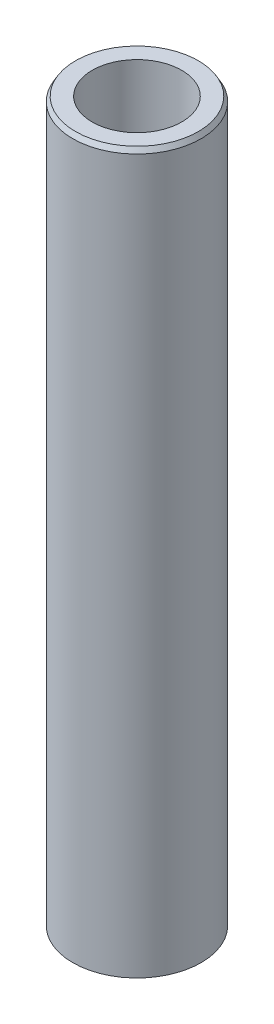
ISO-10303-21;
HEADER;
FILE_DESCRIPTION(('STEP AP214'),'2;1');
FILE_NAME('part.step','',(''),(''),'','','');
FILE_SCHEMA(('AUTOMOTIVE_DESIGN { 1 0 10303 214 1 1 1 1 }'));
ENDSEC;
DATA;
#1=APPLICATION_CONTEXT('core data for automotive mechanical design processes');
#2=APPLICATION_PROTOCOL_DEFINITION('international standard','automotive_design',2000,#1);
#3=PRODUCT_CONTEXT('',#1,'mechanical');
#4=PRODUCT('Part','Part','',(#3));
#5=PRODUCT_RELATED_PRODUCT_CATEGORY('part','',(#4));
#6=PRODUCT_DEFINITION_FORMATION('','',#4);
#7=PRODUCT_DEFINITION_CONTEXT('part definition',#1,'design');
#8=PRODUCT_DEFINITION('design','',#6,#7);
#9=PRODUCT_DEFINITION_SHAPE('','',#8);
#10=(LENGTH_UNIT() NAMED_UNIT(*) SI_UNIT(.MILLI.,.METRE.));
#11=(NAMED_UNIT(*) PLANE_ANGLE_UNIT() SI_UNIT($,.RADIAN.));
#12=(NAMED_UNIT(*) SI_UNIT($,.STERADIAN.) SOLID_ANGLE_UNIT());
#13=UNCERTAINTY_MEASURE_WITH_UNIT(LENGTH_MEASURE(1.E-05),#10,'distance_accuracy_value','');
#14=(GEOMETRIC_REPRESENTATION_CONTEXT(3) GLOBAL_UNCERTAINTY_ASSIGNED_CONTEXT((#13)) GLOBAL_UNIT_ASSIGNED_CONTEXT((#10,
#11,#12)) REPRESENTATION_CONTEXT('',''));
#15=CARTESIAN_POINT('',(0.,0.,0.));
#16=DIRECTION('',(0.,0.,1.));
#17=DIRECTION('',(1.,0.,0.));
#18=AXIS2_PLACEMENT_3D('',#15,#16,#17);
#19=CARTESIAN_POINT('',(0.,533.725468294965,0.));
#20=DIRECTION('',(0.,-1.,0.));
#21=DIRECTION('',(0.,0.,-1.));
#22=AXIS2_PLACEMENT_3D('',#19,#20,#21);
#23=CYLINDRICAL_SURFACE('',#22,47.5);
#24=CARTESIAN_POINT('',(0.,530.173767262922,0.));
#25=DIRECTION('',(0.,1.,0.));
#26=DIRECTION('',(0.,0.,1.));
#27=AXIS2_PLACEMENT_3D('',#24,#25,#26);
#28=CIRCLE('',#27,47.5);
#29=CARTESIAN_POINT('',(0.,530.173767262922,47.5));
#30=VERTEX_POINT('',#29);
#31=EDGE_CURVE('E50',#30,#30,#28,.F.);
#32=ORIENTED_EDGE('',*,*,#31,.T.);
#33=EDGE_LOOP('',(#32));
#34=FACE_BOUND('',#33,.T.);
#35=CARTESIAN_POINT('',(0.,2.05057554693122,0.));
#36=DIRECTION('',(0.,1.,0.));
#37=DIRECTION('',(0.,0.,1.));
#38=AXIS2_PLACEMENT_3D('',#35,#36,#37);
#39=CIRCLE('',#38,47.5);
#40=CARTESIAN_POINT('',(0.,2.05057554693122,47.5));
#41=VERTEX_POINT('',#40);
#42=EDGE_CURVE('E51',#41,#41,#39,.T.);
#43=ORIENTED_EDGE('',*,*,#42,.T.);
#44=EDGE_LOOP('',(#43));
#45=FACE_BOUND('',#44,.T.);
#46=ADVANCED_FACE('F39',(#34,#45),#23,.T.);
#47=CARTESIAN_POINT('',(0.,533.725468294965,0.));
#48=DIRECTION('',(0.,1.,0.));
#49=DIRECTION('',(0.,0.,1.));
#50=AXIS2_PLACEMENT_3D('',#47,#48,#49);
#51=PLANE('',#50);
#52=CARTESIAN_POINT('',(0.,533.725468294965,0.));
#53=DIRECTION('',(0.,1.,0.));
#54=DIRECTION('',(0.,0.,1.));
#55=AXIS2_PLACEMENT_3D('',#52,#53,#54);
#56=CIRCLE('',#55,45.4494244530688);
#57=CARTESIAN_POINT('',(0.,533.725468294965,45.4494244530688));
#58=VERTEX_POINT('',#57);
#59=EDGE_CURVE('E54',#58,#58,#56,.T.);
#60=ORIENTED_EDGE('',*,*,#59,.T.);
#61=EDGE_LOOP('',(#60));
#62=FACE_BOUND('',#61,.T.);
#63=CARTESIAN_POINT('',(0.,533.725468294965,0.));
#64=DIRECTION('',(0.,1.,0.));
#65=DIRECTION('',(0.,0.,1.));
#66=AXIS2_PLACEMENT_3D('',#63,#64,#65);
#67=CIRCLE('',#66,33.1579994287842);
#68=CARTESIAN_POINT('',(0.,533.725468294965,33.1579994287842));
#69=VERTEX_POINT('',#68);
#70=EDGE_CURVE('E58',#69,#69,#67,.T.);
#71=ORIENTED_EDGE('',*,*,#70,.F.);
#72=EDGE_LOOP('',(#71));
#73=FACE_BOUND('',#72,.T.);
#74=ADVANCED_FACE('F69',(#62,#73),#51,.T.);
#75=CARTESIAN_POINT('',(0.,0.,0.));
#76=DIRECTION('',(0.,1.,0.));
#77=DIRECTION('',(0.,0.,1.));
#78=AXIS2_PLACEMENT_3D('',#75,#76,#77);
#79=PLANE('',#78);
#80=CARTESIAN_POINT('',(0.,0.,0.));
#81=DIRECTION('',(0.,1.,0.));
#82=DIRECTION('',(0.,0.,1.));
#83=AXIS2_PLACEMENT_3D('',#80,#81,#82);
#84=CIRCLE('',#83,43.9482989679568);
#85=CARTESIAN_POINT('',(0.,0.,43.9482989679568));
#86=VERTEX_POINT('',#85);
#87=EDGE_CURVE('E10',#86,#86,#84,.F.);
#88=ORIENTED_EDGE('',*,*,#87,.T.);
#89=EDGE_LOOP('',(#88));
#90=FACE_BOUND('',#89,.T.);
#91=CARTESIAN_POINT('',(0.,0.,0.));
#92=DIRECTION('',(0.,1.,0.));
#93=DIRECTION('',(0.,0.,1.));
#94=AXIS2_PLACEMENT_3D('',#91,#92,#93);
#95=CIRCLE('',#94,33.1579994287842);
#96=CARTESIAN_POINT('',(0.,0.,33.1579994287842));
#97=VERTEX_POINT('',#96);
#98=EDGE_CURVE('E63',#97,#97,#95,.T.);
#99=ORIENTED_EDGE('',*,*,#98,.T.);
#100=EDGE_LOOP('',(#99));
#101=FACE_BOUND('',#100,.T.);
#102=ADVANCED_FACE('F75',(#90,#101),#79,.F.);
#103=CARTESIAN_POINT('',(0.,533.725468294965,0.));
#104=DIRECTION('',(0.,-1.,0.));
#105=DIRECTION('',(0.,0.,-1.));
#106=AXIS2_PLACEMENT_3D('',#103,#104,#105);
#107=CYLINDRICAL_SURFACE('',#106,33.1579994287842);
#108=ORIENTED_EDGE('',*,*,#70,.T.);
#109=EDGE_LOOP('',(#108));
#110=FACE_BOUND('',#109,.T.);
#111=ORIENTED_EDGE('',*,*,#98,.F.);
#112=EDGE_LOOP('',(#111));
#113=FACE_BOUND('',#112,.T.);
#114=ADVANCED_FACE('F70',(#110,#113),#107,.F.);
#115=CARTESIAN_POINT('',(0.,533.725468294965,0.));
#116=DIRECTION('',(0.,-1.,0.));
#117=DIRECTION('',(0.,0.,-1.));
#118=AXIS2_PLACEMENT_3D('',#115,#116,#117);
#119=CONICAL_SURFACE('',#118,45.4494244530688,0.523598775598311);
#120=ORIENTED_EDGE('',*,*,#31,.F.);
#121=EDGE_LOOP('',(#120));
#122=FACE_BOUND('',#121,.T.);
#123=ORIENTED_EDGE('',*,*,#59,.F.);
#124=EDGE_LOOP('',(#123));
#125=FACE_BOUND('',#124,.T.);
#126=ADVANCED_FACE('F81',(#122,#125),#119,.T.);
#127=CARTESIAN_POINT('',(0.,2.05057554693122,0.));
#128=DIRECTION('',(0.,1.,0.));
#129=DIRECTION('',(0.,0.,1.));
#130=AXIS2_PLACEMENT_3D('',#127,#128,#129);
#131=CONICAL_SURFACE('',#130,47.5,1.0471975511966);
#132=ORIENTED_EDGE('',*,*,#87,.F.);
#133=EDGE_LOOP('',(#132));
#134=FACE_BOUND('',#133,.T.);
#135=ORIENTED_EDGE('',*,*,#42,.F.);
#136=EDGE_LOOP('',(#135));
#137=FACE_BOUND('',#136,.T.);
#138=ADVANCED_FACE('F45',(#134,#137),#131,.T.);
#139=CLOSED_SHELL('',(#46,#74,#102,#114,#126,#138));
#140=MANIFOLD_SOLID_BREP('B2',#139);
#141=ADVANCED_BREP_SHAPE_REPRESENTATION('',(#18,#140),#14);
#142=SHAPE_DEFINITION_REPRESENTATION(#9,#141);
ENDSEC;
END-ISO-10303-21;
